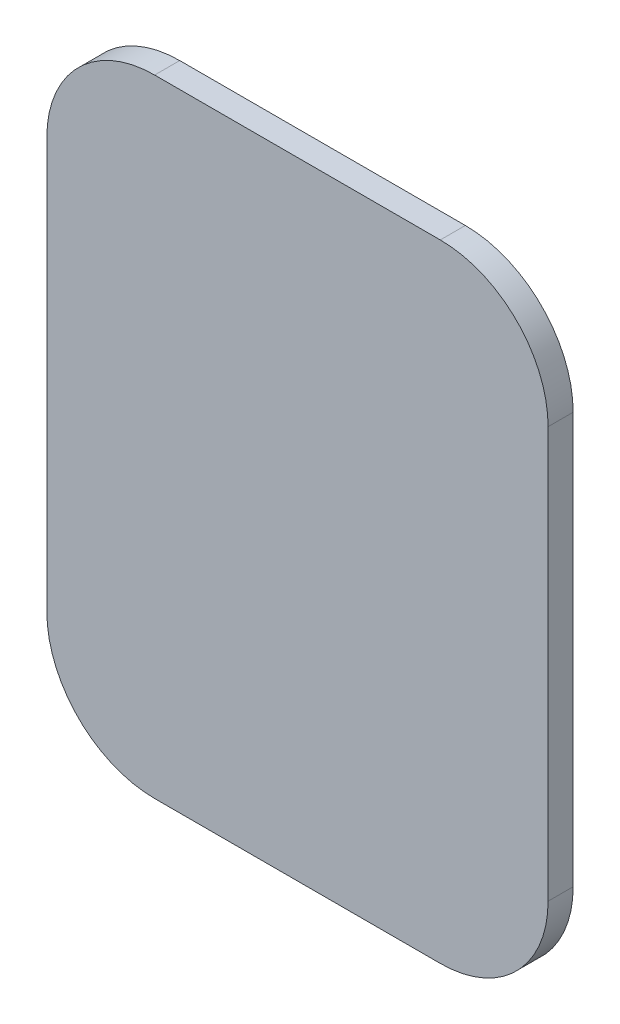
ISO-10303-21;
HEADER;
FILE_DESCRIPTION(('STEP AP214'),'2;1');
FILE_NAME('part.step','',(''),(''),'','','');
FILE_SCHEMA(('AUTOMOTIVE_DESIGN { 1 0 10303 214 1 1 1 1 }'));
ENDSEC;
DATA;
#1=APPLICATION_CONTEXT('core data for automotive mechanical design processes');
#2=APPLICATION_PROTOCOL_DEFINITION('international standard','automotive_design',2000,#1);
#3=PRODUCT_CONTEXT('',#1,'mechanical');
#4=PRODUCT('Part','Part','',(#3));
#5=PRODUCT_RELATED_PRODUCT_CATEGORY('part','',(#4));
#6=PRODUCT_DEFINITION_FORMATION('','',#4);
#7=PRODUCT_DEFINITION_CONTEXT('part definition',#1,'design');
#8=PRODUCT_DEFINITION('design','',#6,#7);
#9=PRODUCT_DEFINITION_SHAPE('','',#8);
#10=(LENGTH_UNIT() NAMED_UNIT(*) SI_UNIT(.MILLI.,.METRE.));
#11=(NAMED_UNIT(*) PLANE_ANGLE_UNIT() SI_UNIT($,.RADIAN.));
#12=(NAMED_UNIT(*) SI_UNIT($,.STERADIAN.) SOLID_ANGLE_UNIT());
#13=UNCERTAINTY_MEASURE_WITH_UNIT(LENGTH_MEASURE(1.E-05),#10,'distance_accuracy_value','');
#14=(GEOMETRIC_REPRESENTATION_CONTEXT(3) GLOBAL_UNCERTAINTY_ASSIGNED_CONTEXT((#13)) GLOBAL_UNIT_ASSIGNED_CONTEXT((#10,
#11,#12)) REPRESENTATION_CONTEXT('',''));
#15=CARTESIAN_POINT('',(0.,0.,0.));
#16=DIRECTION('',(0.,0.,1.));
#17=DIRECTION('',(1.,0.,0.));
#18=AXIS2_PLACEMENT_3D('',#15,#16,#17);
#19=CARTESIAN_POINT('',(0.56979995348837,0.81979995348837,-0.1));
#20=DIRECTION('',(0.,0.,1.));
#21=DIRECTION('',(1.,0.,0.));
#22=AXIS2_PLACEMENT_3D('',#19,#20,#21);
#23=CYLINDRICAL_SURFACE('',#22,0.43020004651163);
#24=CARTESIAN_POINT('',(0.56979995348837,0.81979995348837,0.));
#25=DIRECTION('',(0.,0.,1.));
#26=DIRECTION('',(-1.,0.,0.));
#27=AXIS2_PLACEMENT_3D('',#24,#25,#26);
#28=CIRCLE('',#27,0.43020004651163);
#29=CARTESIAN_POINT('',(1.,0.81979995348837,0.));
#30=VERTEX_POINT('',#29);
#31=CARTESIAN_POINT('',(0.56979995348837,1.25,0.));
#32=VERTEX_POINT('',#31);
#33=EDGE_CURVE('E129',#30,#32,#28,.T.);
#34=ORIENTED_EDGE('',*,*,#33,.F.);
#35=DIRECTION('',(0.,0.,1.));
#36=VECTOR('',#35,1.);
#37=CARTESIAN_POINT('',(1.,0.81979995348837,-0.1));
#38=LINE('',#37,#36);
#39=CARTESIAN_POINT('',(1.,0.81979995348837,-0.1));
#40=VERTEX_POINT('',#39);
#41=EDGE_CURVE('E11',#40,#30,#38,.T.);
#42=ORIENTED_EDGE('',*,*,#41,.F.);
#43=CARTESIAN_POINT('',(0.56979995348837,0.81979995348837,-0.1));
#44=DIRECTION('',(0.,0.,1.));
#45=DIRECTION('',(-1.,0.,0.));
#46=AXIS2_PLACEMENT_3D('',#43,#44,#45);
#47=CIRCLE('',#46,0.43020004651163);
#48=CARTESIAN_POINT('',(0.56979995348837,1.25,-0.1));
#49=VERTEX_POINT('',#48);
#50=EDGE_CURVE('E149',#40,#49,#47,.T.);
#51=ORIENTED_EDGE('',*,*,#50,.T.);
#52=DIRECTION('',(0.,0.,1.));
#53=VECTOR('',#52,1.);
#54=CARTESIAN_POINT('',(0.56979995348837,1.25,-0.1));
#55=LINE('',#54,#53);
#56=EDGE_CURVE('E35',#49,#32,#55,.T.);
#57=ORIENTED_EDGE('',*,*,#56,.T.);
#58=EDGE_LOOP('',(#34,#42,#51,#57));
#59=FACE_BOUND('',#58,.T.);
#60=ADVANCED_FACE('F32',(#59),#23,.T.);
#61=CARTESIAN_POINT('',(1.,0.81979995348837,-0.1));
#62=DIRECTION('',(1.,0.,0.));
#63=DIRECTION('',(0.,1.,0.));
#64=AXIS2_PLACEMENT_3D('',#61,#62,#63);
#65=PLANE('',#64);
#66=DIRECTION('',(0.,1.,0.));
#67=VECTOR('',#66,1.);
#68=CARTESIAN_POINT('',(1.,0.81979995348837,0.));
#69=LINE('',#68,#67);
#70=CARTESIAN_POINT('',(1.,-0.81979995348837,0.));
#71=VERTEX_POINT('',#70);
#72=EDGE_CURVE('E147',#71,#30,#69,.T.);
#73=ORIENTED_EDGE('',*,*,#72,.F.);
#74=DIRECTION('',(0.,0.,1.));
#75=VECTOR('',#74,1.);
#76=CARTESIAN_POINT('',(1.,-0.81979995348837,-0.1));
#77=LINE('',#76,#75);
#78=CARTESIAN_POINT('',(1.,-0.81979995348837,-0.1));
#79=VERTEX_POINT('',#78);
#80=EDGE_CURVE('E41',#79,#71,#77,.T.);
#81=ORIENTED_EDGE('',*,*,#80,.F.);
#82=DIRECTION('',(0.,1.,0.));
#83=VECTOR('',#82,1.);
#84=CARTESIAN_POINT('',(1.,0.81979995348837,-0.1));
#85=LINE('',#84,#83);
#86=EDGE_CURVE('E119',#79,#40,#85,.T.);
#87=ORIENTED_EDGE('',*,*,#86,.T.);
#88=ORIENTED_EDGE('',*,*,#41,.T.);
#89=EDGE_LOOP('',(#73,#81,#87,#88));
#90=FACE_BOUND('',#89,.T.);
#91=ADVANCED_FACE('F161',(#90),#65,.T.);
#92=CARTESIAN_POINT('',(0.56979995348837,-0.81979995348837,-0.1));
#93=DIRECTION('',(0.,0.,1.));
#94=DIRECTION('',(1.,0.,0.));
#95=AXIS2_PLACEMENT_3D('',#92,#93,#94);
#96=CYLINDRICAL_SURFACE('',#95,0.43020004651163);
#97=CARTESIAN_POINT('',(0.56979995348837,-0.81979995348837,0.));
#98=DIRECTION('',(0.,0.,1.));
#99=DIRECTION('',(-1.,0.,0.));
#100=AXIS2_PLACEMENT_3D('',#97,#98,#99);
#101=CIRCLE('',#100,0.43020004651163);
#102=CARTESIAN_POINT('',(0.569799953488371,-1.25,0.));
#103=VERTEX_POINT('',#102);
#104=EDGE_CURVE('E106',#103,#71,#101,.T.);
#105=ORIENTED_EDGE('',*,*,#104,.F.);
#106=DIRECTION('',(0.,0.,1.));
#107=VECTOR('',#106,1.);
#108=CARTESIAN_POINT('',(0.569799953488371,-1.25,-0.1));
#109=LINE('',#108,#107);
#110=CARTESIAN_POINT('',(0.569799953488371,-1.25,-0.1));
#111=VERTEX_POINT('',#110);
#112=EDGE_CURVE('E101',#111,#103,#109,.T.);
#113=ORIENTED_EDGE('',*,*,#112,.F.);
#114=CARTESIAN_POINT('',(0.56979995348837,-0.81979995348837,-0.1));
#115=DIRECTION('',(0.,0.,1.));
#116=DIRECTION('',(-1.,0.,0.));
#117=AXIS2_PLACEMENT_3D('',#114,#115,#116);
#118=CIRCLE('',#117,0.43020004651163);
#119=EDGE_CURVE('E104',#111,#79,#118,.T.);
#120=ORIENTED_EDGE('',*,*,#119,.T.);
#121=ORIENTED_EDGE('',*,*,#80,.T.);
#122=EDGE_LOOP('',(#105,#113,#120,#121));
#123=FACE_BOUND('',#122,.T.);
#124=ADVANCED_FACE('F103',(#123),#96,.T.);
#125=CARTESIAN_POINT('',(0.569799953488371,-1.25,-0.1));
#126=DIRECTION('',(0.,-1.,0.));
#127=DIRECTION('',(1.,0.,0.));
#128=AXIS2_PLACEMENT_3D('',#125,#126,#127);
#129=PLANE('',#128);
#130=DIRECTION('',(1.,0.,0.));
#131=VECTOR('',#130,1.);
#132=CARTESIAN_POINT('',(0.569799953488371,-1.25,0.));
#133=LINE('',#132,#131);
#134=CARTESIAN_POINT('',(-0.56979995348837,-1.25,0.));
#135=VERTEX_POINT('',#134);
#136=EDGE_CURVE('E144',#135,#103,#133,.T.);
#137=ORIENTED_EDGE('',*,*,#136,.F.);
#138=DIRECTION('',(0.,0.,1.));
#139=VECTOR('',#138,1.);
#140=CARTESIAN_POINT('',(-0.56979995348837,-1.25,-0.1));
#141=LINE('',#140,#139);
#142=CARTESIAN_POINT('',(-0.56979995348837,-1.25,-0.1));
#143=VERTEX_POINT('',#142);
#144=EDGE_CURVE('E111',#143,#135,#141,.T.);
#145=ORIENTED_EDGE('',*,*,#144,.F.);
#146=DIRECTION('',(1.,0.,0.));
#147=VECTOR('',#146,1.);
#148=CARTESIAN_POINT('',(0.569799953488371,-1.25,-0.1));
#149=LINE('',#148,#147);
#150=EDGE_CURVE('E117',#143,#111,#149,.T.);
#151=ORIENTED_EDGE('',*,*,#150,.T.);
#152=ORIENTED_EDGE('',*,*,#112,.T.);
#153=EDGE_LOOP('',(#137,#145,#151,#152));
#154=FACE_BOUND('',#153,.T.);
#155=ADVANCED_FACE('F121',(#154),#129,.T.);
#156=CARTESIAN_POINT('',(-0.56979995348837,-0.81979995348837,-0.1));
#157=DIRECTION('',(0.,0.,1.));
#158=DIRECTION('',(1.,0.,0.));
#159=AXIS2_PLACEMENT_3D('',#156,#157,#158);
#160=CYLINDRICAL_SURFACE('',#159,0.43020004651163);
#161=CARTESIAN_POINT('',(-0.56979995348837,-0.81979995348837,0.));
#162=DIRECTION('',(0.,0.,1.));
#163=DIRECTION('',(-1.,0.,0.));
#164=AXIS2_PLACEMENT_3D('',#161,#162,#163);
#165=CIRCLE('',#164,0.43020004651163);
#166=CARTESIAN_POINT('',(-1.,-0.81979995348837,0.));
#167=VERTEX_POINT('',#166);
#168=EDGE_CURVE('E141',#167,#135,#165,.T.);
#169=ORIENTED_EDGE('',*,*,#168,.F.);
#170=DIRECTION('',(0.,0.,1.));
#171=VECTOR('',#170,1.);
#172=CARTESIAN_POINT('',(-1.,-0.81979995348837,-0.1));
#173=LINE('',#172,#171);
#174=CARTESIAN_POINT('',(-1.,-0.81979995348837,-0.1));
#175=VERTEX_POINT('',#174);
#176=EDGE_CURVE('E153',#175,#167,#173,.T.);
#177=ORIENTED_EDGE('',*,*,#176,.F.);
#178=CARTESIAN_POINT('',(-0.56979995348837,-0.81979995348837,-0.1));
#179=DIRECTION('',(0.,0.,1.));
#180=DIRECTION('',(-1.,0.,0.));
#181=AXIS2_PLACEMENT_3D('',#178,#179,#180);
#182=CIRCLE('',#181,0.43020004651163);
#183=EDGE_CURVE('E122',#175,#143,#182,.T.);
#184=ORIENTED_EDGE('',*,*,#183,.T.);
#185=ORIENTED_EDGE('',*,*,#144,.T.);
#186=EDGE_LOOP('',(#169,#177,#184,#185));
#187=FACE_BOUND('',#186,.T.);
#188=ADVANCED_FACE('F174',(#187),#160,.T.);
#189=CARTESIAN_POINT('',(-1.,-0.81979995348837,-0.1));
#190=DIRECTION('',(-1.,0.,0.));
#191=DIRECTION('',(0.,-1.,0.));
#192=AXIS2_PLACEMENT_3D('',#189,#190,#191);
#193=PLANE('',#192);
#194=DIRECTION('',(0.,-1.,0.));
#195=VECTOR('',#194,1.);
#196=CARTESIAN_POINT('',(-1.,-0.81979995348837,0.));
#197=LINE('',#196,#195);
#198=CARTESIAN_POINT('',(-1.,0.81979995348837,0.));
#199=VERTEX_POINT('',#198);
#200=EDGE_CURVE('E138',#199,#167,#197,.T.);
#201=ORIENTED_EDGE('',*,*,#200,.F.);
#202=DIRECTION('',(0.,0.,1.));
#203=VECTOR('',#202,1.);
#204=CARTESIAN_POINT('',(-1.,0.81979995348837,-0.1));
#205=LINE('',#204,#203);
#206=CARTESIAN_POINT('',(-1.,0.81979995348837,-0.1));
#207=VERTEX_POINT('',#206);
#208=EDGE_CURVE('E155',#207,#199,#205,.T.);
#209=ORIENTED_EDGE('',*,*,#208,.F.);
#210=DIRECTION('',(0.,-1.,0.));
#211=VECTOR('',#210,1.);
#212=CARTESIAN_POINT('',(-1.,-0.81979995348837,-0.1));
#213=LINE('',#212,#211);
#214=EDGE_CURVE('E124',#207,#175,#213,.T.);
#215=ORIENTED_EDGE('',*,*,#214,.T.);
#216=ORIENTED_EDGE('',*,*,#176,.T.);
#217=EDGE_LOOP('',(#201,#209,#215,#216));
#218=FACE_BOUND('',#217,.T.);
#219=ADVANCED_FACE('F177',(#218),#193,.T.);
#220=CARTESIAN_POINT('',(-0.56979995348837,0.81979995348837,-0.1));
#221=DIRECTION('',(0.,0.,1.));
#222=DIRECTION('',(1.,0.,0.));
#223=AXIS2_PLACEMENT_3D('',#220,#221,#222);
#224=CYLINDRICAL_SURFACE('',#223,0.43020004651163);
#225=CARTESIAN_POINT('',(-0.56979995348837,0.81979995348837,0.));
#226=DIRECTION('',(0.,0.,1.));
#227=DIRECTION('',(-1.,0.,0.));
#228=AXIS2_PLACEMENT_3D('',#225,#226,#227);
#229=CIRCLE('',#228,0.43020004651163);
#230=CARTESIAN_POINT('',(-0.56979995348837,1.25,0.));
#231=VERTEX_POINT('',#230);
#232=EDGE_CURVE('E135',#231,#199,#229,.T.);
#233=ORIENTED_EDGE('',*,*,#232,.F.);
#234=DIRECTION('',(0.,0.,1.));
#235=VECTOR('',#234,1.);
#236=CARTESIAN_POINT('',(-0.56979995348837,1.25,-0.1));
#237=LINE('',#236,#235);
#238=CARTESIAN_POINT('',(-0.56979995348837,1.25,-0.1));
#239=VERTEX_POINT('',#238);
#240=EDGE_CURVE('E156',#239,#231,#237,.T.);
#241=ORIENTED_EDGE('',*,*,#240,.F.);
#242=CARTESIAN_POINT('',(-0.56979995348837,0.81979995348837,-0.1));
#243=DIRECTION('',(0.,0.,1.));
#244=DIRECTION('',(-1.,0.,0.));
#245=AXIS2_PLACEMENT_3D('',#242,#243,#244);
#246=CIRCLE('',#245,0.43020004651163);
#247=EDGE_CURVE('E252',#239,#207,#246,.T.);
#248=ORIENTED_EDGE('',*,*,#247,.T.);
#249=ORIENTED_EDGE('',*,*,#208,.T.);
#250=EDGE_LOOP('',(#233,#241,#248,#249));
#251=FACE_BOUND('',#250,.T.);
#252=ADVANCED_FACE('F181',(#251),#224,.T.);
#253=CARTESIAN_POINT('',(-0.56979995348837,1.25,-0.1));
#254=DIRECTION('',(0.,1.,0.));
#255=DIRECTION('',(-1.,0.,0.));
#256=AXIS2_PLACEMENT_3D('',#253,#254,#255);
#257=PLANE('',#256);
#258=DIRECTION('',(-1.,0.,0.));
#259=VECTOR('',#258,1.);
#260=CARTESIAN_POINT('',(-0.56979995348837,1.25,0.));
#261=LINE('',#260,#259);
#262=EDGE_CURVE('E132',#32,#231,#261,.T.);
#263=ORIENTED_EDGE('',*,*,#262,.F.);
#264=ORIENTED_EDGE('',*,*,#56,.F.);
#265=DIRECTION('',(-1.,0.,0.));
#266=VECTOR('',#265,1.);
#267=CARTESIAN_POINT('',(-0.56979995348837,1.25,-0.1));
#268=LINE('',#267,#266);
#269=EDGE_CURVE('E253',#49,#239,#268,.T.);
#270=ORIENTED_EDGE('',*,*,#269,.T.);
#271=ORIENTED_EDGE('',*,*,#240,.T.);
#272=EDGE_LOOP('',(#263,#264,#270,#271));
#273=FACE_BOUND('',#272,.T.);
#274=ADVANCED_FACE('F158',(#273),#257,.T.);
#275=CARTESIAN_POINT('',(0.56979995348837,0.81979995348837,-0.1));
#276=DIRECTION('',(0.,0.,-1.));
#277=DIRECTION('',(-1.,0.,0.));
#278=AXIS2_PLACEMENT_3D('',#275,#276,#277);
#279=PLANE('',#278);
#280=ORIENTED_EDGE('',*,*,#50,.F.);
#281=ORIENTED_EDGE('',*,*,#86,.F.);
#282=ORIENTED_EDGE('',*,*,#119,.F.);
#283=ORIENTED_EDGE('',*,*,#150,.F.);
#284=ORIENTED_EDGE('',*,*,#183,.F.);
#285=ORIENTED_EDGE('',*,*,#214,.F.);
#286=ORIENTED_EDGE('',*,*,#247,.F.);
#287=ORIENTED_EDGE('',*,*,#269,.F.);
#288=EDGE_LOOP('',(#280,#281,#282,#283,#284,#285,#286,#287));
#289=FACE_BOUND('',#288,.T.);
#290=ADVANCED_FACE('F115',(#289),#279,.T.);
#291=CARTESIAN_POINT('',(0.56979995348837,0.81979995348837,0.));
#292=DIRECTION('',(0.,0.,-1.));
#293=DIRECTION('',(-1.,0.,0.));
#294=AXIS2_PLACEMENT_3D('',#291,#292,#293);
#295=PLANE('',#294);
#296=ORIENTED_EDGE('',*,*,#33,.T.);
#297=ORIENTED_EDGE('',*,*,#262,.T.);
#298=ORIENTED_EDGE('',*,*,#232,.T.);
#299=ORIENTED_EDGE('',*,*,#200,.T.);
#300=ORIENTED_EDGE('',*,*,#168,.T.);
#301=ORIENTED_EDGE('',*,*,#136,.T.);
#302=ORIENTED_EDGE('',*,*,#104,.T.);
#303=ORIENTED_EDGE('',*,*,#72,.T.);
#304=EDGE_LOOP('',(#296,#297,#298,#299,#300,#301,#302,#303));
#305=FACE_BOUND('',#304,.T.);
#306=ADVANCED_FACE('F160',(#305),#295,.F.);
#307=CLOSED_SHELL('',(#60,#91,#124,#155,#188,#219,#252,#274,#290,#306));
#308=MANIFOLD_SOLID_BREP('B2',#307);
#309=ADVANCED_BREP_SHAPE_REPRESENTATION('',(#18,#308),#14);
#310=SHAPE_DEFINITION_REPRESENTATION(#9,#309);
ENDSEC;
END-ISO-10303-21;
